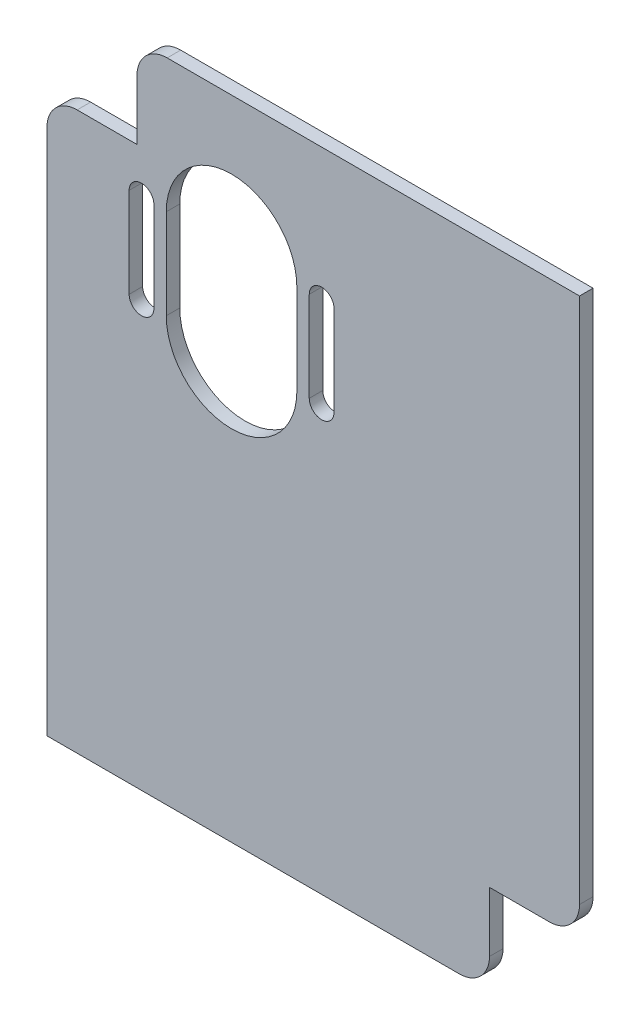
ISO-10303-21;
HEADER;
FILE_DESCRIPTION(('STEP AP214'),'2;1');
FILE_NAME('part.step','',(''),(''),'','','');
FILE_SCHEMA(('AUTOMOTIVE_DESIGN { 1 0 10303 214 1 1 1 1 }'));
ENDSEC;
DATA;
#1=APPLICATION_CONTEXT('core data for automotive mechanical design processes');
#2=APPLICATION_PROTOCOL_DEFINITION('international standard','automotive_design',2000,#1);
#3=PRODUCT_CONTEXT('',#1,'mechanical');
#4=PRODUCT('Part','Part','',(#3));
#5=PRODUCT_RELATED_PRODUCT_CATEGORY('part','',(#4));
#6=PRODUCT_DEFINITION_FORMATION('','',#4);
#7=PRODUCT_DEFINITION_CONTEXT('part definition',#1,'design');
#8=PRODUCT_DEFINITION('design','',#6,#7);
#9=PRODUCT_DEFINITION_SHAPE('','',#8);
#10=(LENGTH_UNIT() NAMED_UNIT(*) SI_UNIT(.MILLI.,.METRE.));
#11=(NAMED_UNIT(*) PLANE_ANGLE_UNIT() SI_UNIT($,.RADIAN.));
#12=(NAMED_UNIT(*) SI_UNIT($,.STERADIAN.) SOLID_ANGLE_UNIT());
#13=UNCERTAINTY_MEASURE_WITH_UNIT(LENGTH_MEASURE(1.E-05),#10,'distance_accuracy_value','');
#14=(GEOMETRIC_REPRESENTATION_CONTEXT(3) GLOBAL_UNCERTAINTY_ASSIGNED_CONTEXT((#13)) GLOBAL_UNIT_ASSIGNED_CONTEXT((#10,
#11,#12)) REPRESENTATION_CONTEXT('',''));
#15=CARTESIAN_POINT('',(0.,0.,0.));
#16=DIRECTION('',(0.,0.,1.));
#17=DIRECTION('',(1.,0.,0.));
#18=AXIS2_PLACEMENT_3D('',#15,#16,#17);
#19=CARTESIAN_POINT('',(0.,0.,3.));
#20=DIRECTION('',(1.,0.,0.));
#21=DIRECTION('',(0.,0.,-1.));
#22=AXIS2_PLACEMENT_3D('',#19,#20,#21);
#23=PLANE('',#22);
#24=DIRECTION('',(0.,-1.,0.));
#25=VECTOR('',#24,1.);
#26=CARTESIAN_POINT('',(0.,0.,3.));
#27=LINE('',#26,#25);
#28=CARTESIAN_POINT('',(0.,117.04,3.));
#29=VERTEX_POINT('',#28);
#30=CARTESIAN_POINT('',(0.,0.,3.));
#31=VERTEX_POINT('',#30);
#32=EDGE_CURVE('E326',#29,#31,#27,.T.);
#33=ORIENTED_EDGE('',*,*,#32,.F.);
#34=DIRECTION('',(0.,0.,1.));
#35=VECTOR('',#34,1.);
#36=CARTESIAN_POINT('',(0.,117.04,3.));
#37=LINE('',#36,#35);
#38=CARTESIAN_POINT('',(0.,117.04,0.));
#39=VERTEX_POINT('',#38);
#40=EDGE_CURVE('E11',#29,#39,#37,.F.);
#41=ORIENTED_EDGE('',*,*,#40,.T.);
#42=DIRECTION('',(0.,-1.,0.));
#43=VECTOR('',#42,1.);
#44=CARTESIAN_POINT('',(0.,0.,0.));
#45=LINE('',#44,#43);
#46=CARTESIAN_POINT('',(0.,0.,0.));
#47=VERTEX_POINT('',#46);
#48=EDGE_CURVE('E322',#39,#47,#45,.T.);
#49=ORIENTED_EDGE('',*,*,#48,.T.);
#50=DIRECTION('',(0.,0.,-1.));
#51=VECTOR('',#50,1.);
#52=CARTESIAN_POINT('',(0.,0.,3.));
#53=LINE('',#52,#51);
#54=EDGE_CURVE('E346',#31,#47,#53,.T.);
#55=ORIENTED_EDGE('',*,*,#54,.F.);
#56=EDGE_LOOP('',(#33,#41,#49,#55));
#57=FACE_BOUND('',#56,.T.);
#58=ADVANCED_FACE('F39',(#57),#23,.F.);
#59=CARTESIAN_POINT('',(118.275,0.,3.));
#60=DIRECTION('',(-1.,0.,0.));
#61=DIRECTION('',(0.,0.,1.));
#62=AXIS2_PLACEMENT_3D('',#59,#60,#61);
#63=PLANE('',#62);
#64=DIRECTION('',(0.,1.,0.));
#65=VECTOR('',#64,1.);
#66=CARTESIAN_POINT('',(118.275,0.,3.));
#67=LINE('',#66,#65);
#68=CARTESIAN_POINT('',(118.275,26.7,3.));
#69=VERTEX_POINT('',#68);
#70=CARTESIAN_POINT('',(118.275,143.74,3.));
#71=VERTEX_POINT('',#70);
#72=EDGE_CURVE('E335',#69,#71,#67,.T.);
#73=ORIENTED_EDGE('',*,*,#72,.F.);
#74=DIRECTION('',(0.,0.,1.));
#75=VECTOR('',#74,1.);
#76=CARTESIAN_POINT('',(118.275,26.7,3.));
#77=LINE('',#76,#75);
#78=CARTESIAN_POINT('',(118.275,26.7,0.));
#79=VERTEX_POINT('',#78);
#80=EDGE_CURVE('E382',#69,#79,#77,.F.);
#81=ORIENTED_EDGE('',*,*,#80,.T.);
#82=DIRECTION('',(0.,1.,0.));
#83=VECTOR('',#82,1.);
#84=CARTESIAN_POINT('',(118.275,0.,0.));
#85=LINE('',#84,#83);
#86=CARTESIAN_POINT('',(118.275,143.74,0.));
#87=VERTEX_POINT('',#86);
#88=EDGE_CURVE('E345',#79,#87,#85,.T.);
#89=ORIENTED_EDGE('',*,*,#88,.T.);
#90=DIRECTION('',(0.,0.,-1.));
#91=VECTOR('',#90,1.);
#92=CARTESIAN_POINT('',(118.275,143.74,3.));
#93=LINE('',#92,#91);
#94=EDGE_CURVE('E340',#71,#87,#93,.T.);
#95=ORIENTED_EDGE('',*,*,#94,.F.);
#96=EDGE_LOOP('',(#73,#81,#89,#95));
#97=FACE_BOUND('',#96,.T.);
#98=ADVANCED_FACE('F401',(#97),#63,.F.);
#99=CARTESIAN_POINT('',(0.,0.,3.));
#100=DIRECTION('',(0.,0.,-1.));
#101=DIRECTION('',(-1.,0.,0.));
#102=AXIS2_PLACEMENT_3D('',#99,#100,#101);
#103=PLANE('',#102);
#104=DIRECTION('',(0.,-1.,0.));
#105=VECTOR('',#104,1.);
#106=CARTESIAN_POINT('',(18.25,114.05,3.));
#107=LINE('',#106,#105);
#108=CARTESIAN_POINT('',(18.25,114.05,3.));
#109=VERTEX_POINT('',#108);
#110=CARTESIAN_POINT('',(18.25,94.05,3.));
#111=VERTEX_POINT('',#110);
#112=EDGE_CURVE('E285',#109,#111,#107,.T.);
#113=ORIENTED_EDGE('',*,*,#112,.F.);
#114=CARTESIAN_POINT('',(21.,114.05,3.));
#115=DIRECTION('',(0.,0.,1.));
#116=DIRECTION('',(1.,0.,0.));
#117=AXIS2_PLACEMENT_3D('',#114,#115,#116);
#118=CIRCLE('',#117,2.75);
#119=CARTESIAN_POINT('',(23.75,114.05,3.));
#120=VERTEX_POINT('',#119);
#121=EDGE_CURVE('E245',#120,#109,#118,.T.);
#122=ORIENTED_EDGE('',*,*,#121,.F.);
#123=DIRECTION('',(0.,1.,0.));
#124=VECTOR('',#123,1.);
#125=CARTESIAN_POINT('',(23.75,114.05,3.));
#126=LINE('',#125,#124);
#127=CARTESIAN_POINT('',(23.75,94.05,3.));
#128=VERTEX_POINT('',#127);
#129=EDGE_CURVE('E273',#128,#120,#126,.T.);
#130=ORIENTED_EDGE('',*,*,#129,.F.);
#131=CARTESIAN_POINT('',(21.,94.05,3.));
#132=DIRECTION('',(0.,0.,1.));
#133=DIRECTION('',(1.,0.,0.));
#134=AXIS2_PLACEMENT_3D('',#131,#132,#133);
#135=CIRCLE('',#134,2.75);
#136=EDGE_CURVE('E279',#111,#128,#135,.T.);
#137=ORIENTED_EDGE('',*,*,#136,.F.);
#138=EDGE_LOOP('',(#113,#122,#130,#137));
#139=FACE_BOUND('',#138,.T.);
#140=DIRECTION('',(0.,-1.,0.));
#141=VECTOR('',#140,1.);
#142=CARTESIAN_POINT('',(58.25,114.05,3.));
#143=LINE('',#142,#141);
#144=CARTESIAN_POINT('',(58.25,114.05,3.));
#145=VERTEX_POINT('',#144);
#146=CARTESIAN_POINT('',(58.25,94.05,3.));
#147=VERTEX_POINT('',#146);
#148=EDGE_CURVE('E249',#145,#147,#143,.T.);
#149=ORIENTED_EDGE('',*,*,#148,.F.);
#150=CARTESIAN_POINT('',(61.,114.05,3.));
#151=DIRECTION('',(0.,0.,1.));
#152=DIRECTION('',(1.,0.,0.));
#153=AXIS2_PLACEMENT_3D('',#150,#151,#152);
#154=CIRCLE('',#153,2.75000000000002);
#155=CARTESIAN_POINT('',(63.75,114.05,3.));
#156=VERTEX_POINT('',#155);
#157=EDGE_CURVE('E254',#156,#145,#154,.T.);
#158=ORIENTED_EDGE('',*,*,#157,.F.);
#159=DIRECTION('',(0.,1.,0.));
#160=VECTOR('',#159,1.);
#161=CARTESIAN_POINT('',(63.75,114.05,3.));
#162=LINE('',#161,#160);
#163=CARTESIAN_POINT('',(63.75,94.05,3.));
#164=VERTEX_POINT('',#163);
#165=EDGE_CURVE('E243',#164,#156,#162,.T.);
#166=ORIENTED_EDGE('',*,*,#165,.F.);
#167=CARTESIAN_POINT('',(61.,94.05,3.));
#168=DIRECTION('',(0.,0.,1.));
#169=DIRECTION('',(1.,0.,0.));
#170=AXIS2_PLACEMENT_3D('',#167,#168,#169);
#171=CIRCLE('',#170,2.75000000000001);
#172=EDGE_CURVE('E246',#147,#164,#171,.T.);
#173=ORIENTED_EDGE('',*,*,#172,.F.);
#174=EDGE_LOOP('',(#149,#158,#166,#173));
#175=FACE_BOUND('',#174,.T.);
#176=DIRECTION('',(0.,-1.,0.));
#177=VECTOR('',#176,1.);
#178=CARTESIAN_POINT('',(26.5,114.05,3.));
#179=LINE('',#178,#177);
#180=CARTESIAN_POINT('',(26.5,114.05,3.));
#181=VERTEX_POINT('',#180);
#182=CARTESIAN_POINT('',(26.5,94.05,3.));
#183=VERTEX_POINT('',#182);
#184=EDGE_CURVE('E311',#181,#183,#179,.T.);
#185=ORIENTED_EDGE('',*,*,#184,.F.);
#186=CARTESIAN_POINT('',(41.,114.05,3.));
#187=DIRECTION('',(0.,0.,1.));
#188=DIRECTION('',(1.,0.,0.));
#189=AXIS2_PLACEMENT_3D('',#186,#187,#188);
#190=CIRCLE('',#189,14.5);
#191=CARTESIAN_POINT('',(55.5,114.05,3.));
#192=VERTEX_POINT('',#191);
#193=EDGE_CURVE('E253',#192,#181,#190,.T.);
#194=ORIENTED_EDGE('',*,*,#193,.F.);
#195=DIRECTION('',(0.,1.,0.));
#196=VECTOR('',#195,1.);
#197=CARTESIAN_POINT('',(55.5,114.05,3.));
#198=LINE('',#197,#196);
#199=CARTESIAN_POINT('',(55.5,94.05,3.));
#200=VERTEX_POINT('',#199);
#201=EDGE_CURVE('E297',#200,#192,#198,.T.);
#202=ORIENTED_EDGE('',*,*,#201,.F.);
#203=CARTESIAN_POINT('',(41.,94.05,3.));
#204=DIRECTION('',(0.,0.,1.));
#205=DIRECTION('',(1.,0.,0.));
#206=AXIS2_PLACEMENT_3D('',#203,#204,#205);
#207=CIRCLE('',#206,14.5);
#208=EDGE_CURVE('E313',#183,#200,#207,.T.);
#209=ORIENTED_EDGE('',*,*,#208,.F.);
#210=EDGE_LOOP('',(#185,#194,#202,#209));
#211=FACE_BOUND('',#210,.T.);
#212=DIRECTION('',(1.,0.,0.));
#213=VECTOR('',#212,1.);
#214=CARTESIAN_POINT('',(0.,0.,3.));
#215=LINE('',#214,#213);
#216=CARTESIAN_POINT('',(91.575,0.,3.));
#217=VERTEX_POINT('',#216);
#218=EDGE_CURVE('E329',#31,#217,#215,.T.);
#219=ORIENTED_EDGE('',*,*,#218,.T.);
#220=CARTESIAN_POINT('',(91.575,6.7,3.));
#221=DIRECTION('',(0.,0.,-1.));
#222=DIRECTION('',(-1.,0.,0.));
#223=AXIS2_PLACEMENT_3D('',#220,#221,#222);
#224=CIRCLE('',#223,6.7);
#225=CARTESIAN_POINT('',(98.275,6.7,3.));
#226=VERTEX_POINT('',#225);
#227=EDGE_CURVE('E370',#217,#226,#224,.F.);
#228=ORIENTED_EDGE('',*,*,#227,.T.);
#229=DIRECTION('',(0.,-1.,0.));
#230=VECTOR('',#229,1.);
#231=CARTESIAN_POINT('',(98.275,0.,3.));
#232=LINE('',#231,#230);
#233=CARTESIAN_POINT('',(98.275,20.,3.));
#234=VERTEX_POINT('',#233);
#235=EDGE_CURVE('E226',#234,#226,#232,.T.);
#236=ORIENTED_EDGE('',*,*,#235,.F.);
#237=DIRECTION('',(-1.,0.,0.));
#238=VECTOR('',#237,1.);
#239=CARTESIAN_POINT('',(118.275,20.,3.));
#240=LINE('',#239,#238);
#241=CARTESIAN_POINT('',(111.575,20.,3.));
#242=VERTEX_POINT('',#241);
#243=EDGE_CURVE('E209',#242,#234,#240,.T.);
#244=ORIENTED_EDGE('',*,*,#243,.F.);
#245=CARTESIAN_POINT('',(111.575,26.7,3.));
#246=DIRECTION('',(0.,0.,-1.));
#247=DIRECTION('',(-1.,0.,0.));
#248=AXIS2_PLACEMENT_3D('',#245,#246,#247);
#249=CIRCLE('',#248,6.7);
#250=EDGE_CURVE('E362',#242,#69,#249,.F.);
#251=ORIENTED_EDGE('',*,*,#250,.T.);
#252=ORIENTED_EDGE('',*,*,#72,.T.);
#253=DIRECTION('',(-1.,0.,0.));
#254=VECTOR('',#253,1.);
#255=CARTESIAN_POINT('',(0.,143.74,3.));
#256=LINE('',#255,#254);
#257=CARTESIAN_POINT('',(26.7,143.74,3.));
#258=VERTEX_POINT('',#257);
#259=EDGE_CURVE('E332',#71,#258,#256,.T.);
#260=ORIENTED_EDGE('',*,*,#259,.T.);
#261=CARTESIAN_POINT('',(26.7,137.04,3.));
#262=DIRECTION('',(0.,0.,-1.));
#263=DIRECTION('',(-1.,0.,0.));
#264=AXIS2_PLACEMENT_3D('',#261,#262,#263);
#265=CIRCLE('',#264,6.7);
#266=CARTESIAN_POINT('',(20.,137.04,3.));
#267=VERTEX_POINT('',#266);
#268=EDGE_CURVE('E221',#258,#267,#265,.F.);
#269=ORIENTED_EDGE('',*,*,#268,.T.);
#270=DIRECTION('',(0.,1.,0.));
#271=VECTOR('',#270,1.);
#272=CARTESIAN_POINT('',(20.,143.74,3.));
#273=LINE('',#272,#271);
#274=CARTESIAN_POINT('',(20.,123.74,3.));
#275=VERTEX_POINT('',#274);
#276=EDGE_CURVE('E206',#275,#267,#273,.T.);
#277=ORIENTED_EDGE('',*,*,#276,.F.);
#278=DIRECTION('',(1.,0.,0.));
#279=VECTOR('',#278,1.);
#280=CARTESIAN_POINT('',(0.,123.74,3.));
#281=LINE('',#280,#279);
#282=CARTESIAN_POINT('',(6.7,123.74,3.));
#283=VERTEX_POINT('',#282);
#284=EDGE_CURVE('E204',#283,#275,#281,.T.);
#285=ORIENTED_EDGE('',*,*,#284,.F.);
#286=CARTESIAN_POINT('',(6.7,117.04,3.));
#287=DIRECTION('',(0.,0.,-1.));
#288=DIRECTION('',(-1.,0.,0.));
#289=AXIS2_PLACEMENT_3D('',#286,#287,#288);
#290=CIRCLE('',#289,6.7);
#291=EDGE_CURVE('E365',#283,#29,#290,.F.);
#292=ORIENTED_EDGE('',*,*,#291,.T.);
#293=ORIENTED_EDGE('',*,*,#32,.T.);
#294=EDGE_LOOP('',(#219,#228,#236,#244,#251,#252,#260,#269,#277,#285,#292,#293));
#295=FACE_BOUND('',#294,.T.);
#296=ADVANCED_FACE('F219',(#139,#175,#211,#295),#103,.F.);
#297=CARTESIAN_POINT('',(0.,0.,3.));
#298=DIRECTION('',(0.,1.,0.));
#299=DIRECTION('',(0.,0.,1.));
#300=AXIS2_PLACEMENT_3D('',#297,#298,#299);
#301=PLANE('',#300);
#302=DIRECTION('',(1.,0.,0.));
#303=VECTOR('',#302,1.);
#304=CARTESIAN_POINT('',(0.,0.,0.));
#305=LINE('',#304,#303);
#306=CARTESIAN_POINT('',(91.575,0.,0.));
#307=VERTEX_POINT('',#306);
#308=EDGE_CURVE('E339',#47,#307,#305,.T.);
#309=ORIENTED_EDGE('',*,*,#308,.T.);
#310=DIRECTION('',(0.,0.,1.));
#311=VECTOR('',#310,1.);
#312=CARTESIAN_POINT('',(91.575,0.,3.));
#313=LINE('',#312,#311);
#314=EDGE_CURVE('E360',#307,#217,#313,.T.);
#315=ORIENTED_EDGE('',*,*,#314,.T.);
#316=ORIENTED_EDGE('',*,*,#218,.F.);
#317=ORIENTED_EDGE('',*,*,#54,.T.);
#318=EDGE_LOOP('',(#309,#315,#316,#317));
#319=FACE_BOUND('',#318,.T.);
#320=ADVANCED_FACE('F421',(#319),#301,.F.);
#321=CARTESIAN_POINT('',(0.,143.74,3.));
#322=DIRECTION('',(0.,-1.,0.));
#323=DIRECTION('',(0.,0.,-1.));
#324=AXIS2_PLACEMENT_3D('',#321,#322,#323);
#325=PLANE('',#324);
#326=DIRECTION('',(-1.,0.,0.));
#327=VECTOR('',#326,1.);
#328=CARTESIAN_POINT('',(0.,143.74,0.));
#329=LINE('',#328,#327);
#330=CARTESIAN_POINT('',(26.7,143.74,0.));
#331=VERTEX_POINT('',#330);
#332=EDGE_CURVE('E334',#87,#331,#329,.T.);
#333=ORIENTED_EDGE('',*,*,#332,.T.);
#334=DIRECTION('',(0.,0.,1.));
#335=VECTOR('',#334,1.);
#336=CARTESIAN_POINT('',(26.7,143.74,3.));
#337=LINE('',#336,#335);
#338=EDGE_CURVE('E384',#331,#258,#337,.T.);
#339=ORIENTED_EDGE('',*,*,#338,.T.);
#340=ORIENTED_EDGE('',*,*,#259,.F.);
#341=ORIENTED_EDGE('',*,*,#94,.T.);
#342=EDGE_LOOP('',(#333,#339,#340,#341));
#343=FACE_BOUND('',#342,.T.);
#344=ADVANCED_FACE('F396',(#343),#325,.F.);
#345=CARTESIAN_POINT('',(0.,0.,0.));
#346=DIRECTION('',(0.,0.,-1.));
#347=DIRECTION('',(-1.,0.,0.));
#348=AXIS2_PLACEMENT_3D('',#345,#346,#347);
#349=PLANE('',#348);
#350=DIRECTION('',(0.,1.,0.));
#351=VECTOR('',#350,1.);
#352=CARTESIAN_POINT('',(98.275,0.,0.));
#353=LINE('',#352,#351);
#354=CARTESIAN_POINT('',(98.275,6.7,0.));
#355=VERTEX_POINT('',#354);
#356=CARTESIAN_POINT('',(98.275,20.,0.));
#357=VERTEX_POINT('',#356);
#358=EDGE_CURVE('E353',#355,#357,#353,.T.);
#359=ORIENTED_EDGE('',*,*,#358,.F.);
#360=CARTESIAN_POINT('',(91.575,6.7,0.));
#361=DIRECTION('',(0.,0.,-1.));
#362=DIRECTION('',(-1.,0.,0.));
#363=AXIS2_PLACEMENT_3D('',#360,#361,#362);
#364=CIRCLE('',#363,6.7);
#365=EDGE_CURVE('E376',#355,#307,#364,.T.);
#366=ORIENTED_EDGE('',*,*,#365,.T.);
#367=ORIENTED_EDGE('',*,*,#308,.F.);
#368=ORIENTED_EDGE('',*,*,#48,.F.);
#369=CARTESIAN_POINT('',(6.7,117.04,0.));
#370=DIRECTION('',(0.,0.,-1.));
#371=DIRECTION('',(-1.,0.,0.));
#372=AXIS2_PLACEMENT_3D('',#369,#370,#371);
#373=CIRCLE('',#372,6.7);
#374=CARTESIAN_POINT('',(6.7,123.74,0.));
#375=VERTEX_POINT('',#374);
#376=EDGE_CURVE('E53',#39,#375,#373,.T.);
#377=ORIENTED_EDGE('',*,*,#376,.T.);
#378=DIRECTION('',(-1.,0.,0.));
#379=VECTOR('',#378,1.);
#380=CARTESIAN_POINT('',(0.,123.74,0.));
#381=LINE('',#380,#379);
#382=CARTESIAN_POINT('',(20.,123.74,0.));
#383=VERTEX_POINT('',#382);
#384=EDGE_CURVE('E358',#383,#375,#381,.T.);
#385=ORIENTED_EDGE('',*,*,#384,.F.);
#386=DIRECTION('',(0.,-1.,0.));
#387=VECTOR('',#386,1.);
#388=CARTESIAN_POINT('',(20.,0.,0.));
#389=LINE('',#388,#387);
#390=CARTESIAN_POINT('',(20.,137.04,0.));
#391=VERTEX_POINT('',#390);
#392=EDGE_CURVE('E218',#391,#383,#389,.T.);
#393=ORIENTED_EDGE('',*,*,#392,.F.);
#394=CARTESIAN_POINT('',(26.7,137.04,0.));
#395=DIRECTION('',(0.,0.,-1.));
#396=DIRECTION('',(-1.,0.,0.));
#397=AXIS2_PLACEMENT_3D('',#394,#395,#396);
#398=CIRCLE('',#397,6.7);
#399=EDGE_CURVE('E375',#391,#331,#398,.T.);
#400=ORIENTED_EDGE('',*,*,#399,.T.);
#401=ORIENTED_EDGE('',*,*,#332,.F.);
#402=ORIENTED_EDGE('',*,*,#88,.F.);
#403=CARTESIAN_POINT('',(111.575,26.7,0.));
#404=DIRECTION('',(0.,0.,-1.));
#405=DIRECTION('',(-1.,0.,0.));
#406=AXIS2_PLACEMENT_3D('',#403,#404,#405);
#407=CIRCLE('',#406,6.7);
#408=CARTESIAN_POINT('',(111.575,20.,0.));
#409=VERTEX_POINT('',#408);
#410=EDGE_CURVE('E372',#79,#409,#407,.T.);
#411=ORIENTED_EDGE('',*,*,#410,.T.);
#412=DIRECTION('',(1.,0.,0.));
#413=VECTOR('',#412,1.);
#414=CARTESIAN_POINT('',(0.,20.,0.));
#415=LINE('',#414,#413);
#416=EDGE_CURVE('E354',#357,#409,#415,.T.);
#417=ORIENTED_EDGE('',*,*,#416,.F.);
#418=EDGE_LOOP('',(#359,#366,#367,#368,#377,#385,#393,#400,#401,#402,#411,#417));
#419=FACE_BOUND('',#418,.T.);
#420=CARTESIAN_POINT('',(21.,114.05,0.));
#421=DIRECTION('',(0.,0.,1.));
#422=DIRECTION('',(1.,0.,0.));
#423=AXIS2_PLACEMENT_3D('',#420,#421,#422);
#424=CIRCLE('',#423,2.75);
#425=CARTESIAN_POINT('',(23.75,114.05,0.));
#426=VERTEX_POINT('',#425);
#427=CARTESIAN_POINT('',(18.25,114.05,0.));
#428=VERTEX_POINT('',#427);
#429=EDGE_CURVE('E276',#426,#428,#424,.T.);
#430=ORIENTED_EDGE('',*,*,#429,.T.);
#431=DIRECTION('',(0.,-1.,0.));
#432=VECTOR('',#431,1.);
#433=CARTESIAN_POINT('',(18.25,114.05,0.));
#434=LINE('',#433,#432);
#435=CARTESIAN_POINT('',(18.25,94.05,0.));
#436=VERTEX_POINT('',#435);
#437=EDGE_CURVE('E293',#428,#436,#434,.T.);
#438=ORIENTED_EDGE('',*,*,#437,.T.);
#439=CARTESIAN_POINT('',(21.,94.05,0.));
#440=DIRECTION('',(0.,0.,1.));
#441=DIRECTION('',(1.,0.,0.));
#442=AXIS2_PLACEMENT_3D('',#439,#440,#441);
#443=CIRCLE('',#442,2.75);
#444=CARTESIAN_POINT('',(23.75,94.05,0.));
#445=VERTEX_POINT('',#444);
#446=EDGE_CURVE('E290',#436,#445,#443,.T.);
#447=ORIENTED_EDGE('',*,*,#446,.T.);
#448=DIRECTION('',(0.,1.,0.));
#449=VECTOR('',#448,1.);
#450=CARTESIAN_POINT('',(23.75,114.05,0.));
#451=LINE('',#450,#449);
#452=EDGE_CURVE('E268',#445,#426,#451,.T.);
#453=ORIENTED_EDGE('',*,*,#452,.T.);
#454=EDGE_LOOP('',(#430,#438,#447,#453));
#455=FACE_BOUND('',#454,.T.);
#456=CARTESIAN_POINT('',(61.,114.05,0.));
#457=DIRECTION('',(0.,0.,1.));
#458=DIRECTION('',(1.,0.,0.));
#459=AXIS2_PLACEMENT_3D('',#456,#457,#458);
#460=CIRCLE('',#459,2.75000000000002);
#461=CARTESIAN_POINT('',(63.75,114.05,0.));
#462=VERTEX_POINT('',#461);
#463=CARTESIAN_POINT('',(58.25,114.05,0.));
#464=VERTEX_POINT('',#463);
#465=EDGE_CURVE('E250',#462,#464,#460,.T.);
#466=ORIENTED_EDGE('',*,*,#465,.T.);
#467=DIRECTION('',(0.,-1.,0.));
#468=VECTOR('',#467,1.);
#469=CARTESIAN_POINT('',(58.25,114.05,0.));
#470=LINE('',#469,#468);
#471=CARTESIAN_POINT('',(58.25,94.05,0.));
#472=VERTEX_POINT('',#471);
#473=EDGE_CURVE('E263',#464,#472,#470,.T.);
#474=ORIENTED_EDGE('',*,*,#473,.T.);
#475=CARTESIAN_POINT('',(61.,94.05,0.));
#476=DIRECTION('',(0.,0.,1.));
#477=DIRECTION('',(1.,0.,0.));
#478=AXIS2_PLACEMENT_3D('',#475,#476,#477);
#479=CIRCLE('',#478,2.75000000000001);
#480=CARTESIAN_POINT('',(63.75,94.05,0.));
#481=VERTEX_POINT('',#480);
#482=EDGE_CURVE('E259',#472,#481,#479,.T.);
#483=ORIENTED_EDGE('',*,*,#482,.T.);
#484=DIRECTION('',(0.,1.,0.));
#485=VECTOR('',#484,1.);
#486=CARTESIAN_POINT('',(63.75,114.05,0.));
#487=LINE('',#486,#485);
#488=EDGE_CURVE('E232',#481,#462,#487,.T.);
#489=ORIENTED_EDGE('',*,*,#488,.T.);
#490=EDGE_LOOP('',(#466,#474,#483,#489));
#491=FACE_BOUND('',#490,.T.);
#492=CARTESIAN_POINT('',(41.,114.05,0.));
#493=DIRECTION('',(0.,0.,1.));
#494=DIRECTION('',(1.,0.,0.));
#495=AXIS2_PLACEMENT_3D('',#492,#493,#494);
#496=CIRCLE('',#495,14.5);
#497=CARTESIAN_POINT('',(55.5,114.05,0.));
#498=VERTEX_POINT('',#497);
#499=CARTESIAN_POINT('',(26.5,114.05,0.));
#500=VERTEX_POINT('',#499);
#501=EDGE_CURVE('E298',#498,#500,#496,.T.);
#502=ORIENTED_EDGE('',*,*,#501,.T.);
#503=DIRECTION('',(0.,-1.,0.));
#504=VECTOR('',#503,1.);
#505=CARTESIAN_POINT('',(26.5,114.05,0.));
#506=LINE('',#505,#504);
#507=CARTESIAN_POINT('',(26.5,94.05,0.));
#508=VERTEX_POINT('',#507);
#509=EDGE_CURVE('E299',#500,#508,#506,.T.);
#510=ORIENTED_EDGE('',*,*,#509,.T.);
#511=CARTESIAN_POINT('',(41.,94.05,0.));
#512=DIRECTION('',(0.,0.,1.));
#513=DIRECTION('',(1.,0.,0.));
#514=AXIS2_PLACEMENT_3D('',#511,#512,#513);
#515=CIRCLE('',#514,14.5);
#516=CARTESIAN_POINT('',(55.5,94.05,0.));
#517=VERTEX_POINT('',#516);
#518=EDGE_CURVE('E303',#508,#517,#515,.T.);
#519=ORIENTED_EDGE('',*,*,#518,.T.);
#520=DIRECTION('',(0.,1.,0.));
#521=VECTOR('',#520,1.);
#522=CARTESIAN_POINT('',(55.5,114.05,0.));
#523=LINE('',#522,#521);
#524=EDGE_CURVE('E306',#517,#498,#523,.T.);
#525=ORIENTED_EDGE('',*,*,#524,.T.);
#526=EDGE_LOOP('',(#502,#510,#519,#525));
#527=FACE_BOUND('',#526,.T.);
#528=ADVANCED_FACE('F388',(#419,#455,#491,#527),#349,.T.);
#529=CARTESIAN_POINT('',(41.,114.05,0.));
#530=DIRECTION('',(0.,0.,1.));
#531=DIRECTION('',(1.,0.,0.));
#532=AXIS2_PLACEMENT_3D('',#529,#530,#531);
#533=CYLINDRICAL_SURFACE('',#532,14.5);
#534=ORIENTED_EDGE('',*,*,#193,.T.);
#535=DIRECTION('',(0.,0.,1.));
#536=VECTOR('',#535,1.);
#537=CARTESIAN_POINT('',(26.5,114.05,0.));
#538=LINE('',#537,#536);
#539=EDGE_CURVE('E307',#500,#181,#538,.T.);
#540=ORIENTED_EDGE('',*,*,#539,.F.);
#541=ORIENTED_EDGE('',*,*,#501,.F.);
#542=DIRECTION('',(0.,0.,1.));
#543=VECTOR('',#542,1.);
#544=CARTESIAN_POINT('',(55.5,114.05,0.));
#545=LINE('',#544,#543);
#546=EDGE_CURVE('E316',#498,#192,#545,.T.);
#547=ORIENTED_EDGE('',*,*,#546,.T.);
#548=EDGE_LOOP('',(#534,#540,#541,#547));
#549=FACE_BOUND('',#548,.T.);
#550=ADVANCED_FACE('F608',(#549),#533,.F.);
#551=CARTESIAN_POINT('',(55.5,114.05,0.));
#552=DIRECTION('',(1.,0.,0.));
#553=DIRECTION('',(0.,1.,0.));
#554=AXIS2_PLACEMENT_3D('',#551,#552,#553);
#555=PLANE('',#554);
#556=ORIENTED_EDGE('',*,*,#201,.T.);
#557=ORIENTED_EDGE('',*,*,#546,.F.);
#558=ORIENTED_EDGE('',*,*,#524,.F.);
#559=DIRECTION('',(0.,0.,1.));
#560=VECTOR('',#559,1.);
#561=CARTESIAN_POINT('',(55.5,94.05,0.));
#562=LINE('',#561,#560);
#563=EDGE_CURVE('E325',#517,#200,#562,.T.);
#564=ORIENTED_EDGE('',*,*,#563,.T.);
#565=EDGE_LOOP('',(#556,#557,#558,#564));
#566=FACE_BOUND('',#565,.T.);
#567=ADVANCED_FACE('F600',(#566),#555,.F.);
#568=CARTESIAN_POINT('',(41.,94.05,0.));
#569=DIRECTION('',(0.,0.,1.));
#570=DIRECTION('',(1.,0.,0.));
#571=AXIS2_PLACEMENT_3D('',#568,#569,#570);
#572=CYLINDRICAL_SURFACE('',#571,14.5);
#573=ORIENTED_EDGE('',*,*,#208,.T.);
#574=ORIENTED_EDGE('',*,*,#563,.F.);
#575=ORIENTED_EDGE('',*,*,#518,.F.);
#576=DIRECTION('',(0.,0.,1.));
#577=VECTOR('',#576,1.);
#578=CARTESIAN_POINT('',(26.5,94.05,0.));
#579=LINE('',#578,#577);
#580=EDGE_CURVE('E321',#508,#183,#579,.T.);
#581=ORIENTED_EDGE('',*,*,#580,.T.);
#582=EDGE_LOOP('',(#573,#574,#575,#581));
#583=FACE_BOUND('',#582,.T.);
#584=ADVANCED_FACE('F586',(#583),#572,.F.);
#585=CARTESIAN_POINT('',(26.5,114.05,0.));
#586=DIRECTION('',(-1.,0.,0.));
#587=DIRECTION('',(0.,-1.,0.));
#588=AXIS2_PLACEMENT_3D('',#585,#586,#587);
#589=PLANE('',#588);
#590=ORIENTED_EDGE('',*,*,#184,.T.);
#591=ORIENTED_EDGE('',*,*,#580,.F.);
#592=ORIENTED_EDGE('',*,*,#509,.F.);
#593=ORIENTED_EDGE('',*,*,#539,.T.);
#594=EDGE_LOOP('',(#590,#591,#592,#593));
#595=FACE_BOUND('',#594,.T.);
#596=ADVANCED_FACE('F576',(#595),#589,.F.);
#597=CARTESIAN_POINT('',(61.,114.05,0.));
#598=DIRECTION('',(0.,0.,1.));
#599=DIRECTION('',(1.,0.,0.));
#600=AXIS2_PLACEMENT_3D('',#597,#598,#599);
#601=CYLINDRICAL_SURFACE('',#600,2.75000000000002);
#602=ORIENTED_EDGE('',*,*,#157,.T.);
#603=DIRECTION('',(0.,0.,1.));
#604=VECTOR('',#603,1.);
#605=CARTESIAN_POINT('',(58.25,114.05,0.));
#606=LINE('',#605,#604);
#607=EDGE_CURVE('E235',#464,#145,#606,.T.);
#608=ORIENTED_EDGE('',*,*,#607,.F.);
#609=ORIENTED_EDGE('',*,*,#465,.F.);
#610=DIRECTION('',(0.,0.,1.));
#611=VECTOR('',#610,1.);
#612=CARTESIAN_POINT('',(63.75,114.05,0.));
#613=LINE('',#612,#611);
#614=EDGE_CURVE('E239',#462,#156,#613,.T.);
#615=ORIENTED_EDGE('',*,*,#614,.T.);
#616=EDGE_LOOP('',(#602,#608,#609,#615));
#617=FACE_BOUND('',#616,.T.);
#618=ADVANCED_FACE('F569',(#617),#601,.F.);
#619=CARTESIAN_POINT('',(63.75,114.05,0.));
#620=DIRECTION('',(1.,0.,0.));
#621=DIRECTION('',(0.,0.,-1.));
#622=AXIS2_PLACEMENT_3D('',#619,#620,#621);
#623=PLANE('',#622);
#624=ORIENTED_EDGE('',*,*,#165,.T.);
#625=ORIENTED_EDGE('',*,*,#614,.F.);
#626=ORIENTED_EDGE('',*,*,#488,.F.);
#627=DIRECTION('',(0.,0.,1.));
#628=VECTOR('',#627,1.);
#629=CARTESIAN_POINT('',(63.75,94.05,0.));
#630=LINE('',#629,#628);
#631=EDGE_CURVE('E238',#481,#164,#630,.T.);
#632=ORIENTED_EDGE('',*,*,#631,.T.);
#633=EDGE_LOOP('',(#624,#625,#626,#632));
#634=FACE_BOUND('',#633,.T.);
#635=ADVANCED_FACE('F561',(#634),#623,.F.);
#636=CARTESIAN_POINT('',(61.,94.05,0.));
#637=DIRECTION('',(0.,0.,1.));
#638=DIRECTION('',(1.,0.,0.));
#639=AXIS2_PLACEMENT_3D('',#636,#637,#638);
#640=CYLINDRICAL_SURFACE('',#639,2.75000000000001);
#641=ORIENTED_EDGE('',*,*,#172,.T.);
#642=ORIENTED_EDGE('',*,*,#631,.F.);
#643=ORIENTED_EDGE('',*,*,#482,.F.);
#644=DIRECTION('',(0.,0.,1.));
#645=VECTOR('',#644,1.);
#646=CARTESIAN_POINT('',(58.25,94.05,0.));
#647=LINE('',#646,#645);
#648=EDGE_CURVE('E236',#472,#147,#647,.T.);
#649=ORIENTED_EDGE('',*,*,#648,.T.);
#650=EDGE_LOOP('',(#641,#642,#643,#649));
#651=FACE_BOUND('',#650,.T.);
#652=ADVANCED_FACE('F552',(#651),#640,.F.);
#653=CARTESIAN_POINT('',(58.25,114.05,0.));
#654=DIRECTION('',(-1.,0.,0.));
#655=DIRECTION('',(0.,-1.,0.));
#656=AXIS2_PLACEMENT_3D('',#653,#654,#655);
#657=PLANE('',#656);
#658=ORIENTED_EDGE('',*,*,#148,.T.);
#659=ORIENTED_EDGE('',*,*,#648,.F.);
#660=ORIENTED_EDGE('',*,*,#473,.F.);
#661=ORIENTED_EDGE('',*,*,#607,.T.);
#662=EDGE_LOOP('',(#658,#659,#660,#661));
#663=FACE_BOUND('',#662,.T.);
#664=ADVANCED_FACE('F541',(#663),#657,.F.);
#665=CARTESIAN_POINT('',(21.,114.05,0.));
#666=DIRECTION('',(0.,0.,1.));
#667=DIRECTION('',(1.,0.,0.));
#668=AXIS2_PLACEMENT_3D('',#665,#666,#667);
#669=CYLINDRICAL_SURFACE('',#668,2.75);
#670=ORIENTED_EDGE('',*,*,#121,.T.);
#671=DIRECTION('',(0.,0.,1.));
#672=VECTOR('',#671,1.);
#673=CARTESIAN_POINT('',(18.25,114.05,0.));
#674=LINE('',#673,#672);
#675=EDGE_CURVE('E269',#428,#109,#674,.T.);
#676=ORIENTED_EDGE('',*,*,#675,.F.);
#677=ORIENTED_EDGE('',*,*,#429,.F.);
#678=DIRECTION('',(0.,0.,1.));
#679=VECTOR('',#678,1.);
#680=CARTESIAN_POINT('',(23.75,114.05,0.));
#681=LINE('',#680,#679);
#682=EDGE_CURVE('E220',#426,#120,#681,.T.);
#683=ORIENTED_EDGE('',*,*,#682,.T.);
#684=EDGE_LOOP('',(#670,#676,#677,#683));
#685=FACE_BOUND('',#684,.T.);
#686=ADVANCED_FACE('F534',(#685),#669,.F.);
#687=CARTESIAN_POINT('',(23.75,114.05,0.));
#688=DIRECTION('',(1.,0.,0.));
#689=DIRECTION('',(0.,1.,0.));
#690=AXIS2_PLACEMENT_3D('',#687,#688,#689);
#691=PLANE('',#690);
#692=ORIENTED_EDGE('',*,*,#129,.T.);
#693=ORIENTED_EDGE('',*,*,#682,.F.);
#694=ORIENTED_EDGE('',*,*,#452,.F.);
#695=DIRECTION('',(0.,0.,1.));
#696=VECTOR('',#695,1.);
#697=CARTESIAN_POINT('',(23.75,94.05,0.));
#698=LINE('',#697,#696);
#699=EDGE_CURVE('E275',#445,#128,#698,.T.);
#700=ORIENTED_EDGE('',*,*,#699,.T.);
#701=EDGE_LOOP('',(#692,#693,#694,#700));
#702=FACE_BOUND('',#701,.T.);
#703=ADVANCED_FACE('F524',(#702),#691,.F.);
#704=CARTESIAN_POINT('',(21.,94.05,0.));
#705=DIRECTION('',(0.,0.,1.));
#706=DIRECTION('',(1.,0.,0.));
#707=AXIS2_PLACEMENT_3D('',#704,#705,#706);
#708=CYLINDRICAL_SURFACE('',#707,2.75);
#709=ORIENTED_EDGE('',*,*,#136,.T.);
#710=ORIENTED_EDGE('',*,*,#699,.F.);
#711=ORIENTED_EDGE('',*,*,#446,.F.);
#712=DIRECTION('',(0.,0.,1.));
#713=VECTOR('',#712,1.);
#714=CARTESIAN_POINT('',(18.25,94.05,0.));
#715=LINE('',#714,#713);
#716=EDGE_CURVE('E267',#436,#111,#715,.T.);
#717=ORIENTED_EDGE('',*,*,#716,.T.);
#718=EDGE_LOOP('',(#709,#710,#711,#717));
#719=FACE_BOUND('',#718,.T.);
#720=ADVANCED_FACE('F517',(#719),#708,.F.);
#721=CARTESIAN_POINT('',(18.25,114.05,0.));
#722=DIRECTION('',(-1.,0.,0.));
#723=DIRECTION('',(0.,-1.,0.));
#724=AXIS2_PLACEMENT_3D('',#721,#722,#723);
#725=PLANE('',#724);
#726=ORIENTED_EDGE('',*,*,#112,.T.);
#727=ORIENTED_EDGE('',*,*,#716,.F.);
#728=ORIENTED_EDGE('',*,*,#437,.F.);
#729=ORIENTED_EDGE('',*,*,#675,.T.);
#730=EDGE_LOOP('',(#726,#727,#728,#729));
#731=FACE_BOUND('',#730,.T.);
#732=ADVANCED_FACE('F489',(#731),#725,.F.);
#733=CARTESIAN_POINT('',(98.275,0.,-7.));
#734=DIRECTION('',(-1.,0.,0.));
#735=DIRECTION('',(0.,0.,1.));
#736=AXIS2_PLACEMENT_3D('',#733,#734,#735);
#737=PLANE('',#736);
#738=ORIENTED_EDGE('',*,*,#235,.T.);
#739=DIRECTION('',(0.,0.,1.));
#740=VECTOR('',#739,1.);
#741=CARTESIAN_POINT('',(98.275,6.7,-7.));
#742=LINE('',#741,#740);
#743=EDGE_CURVE('E367',#226,#355,#742,.F.);
#744=ORIENTED_EDGE('',*,*,#743,.T.);
#745=ORIENTED_EDGE('',*,*,#358,.T.);
#746=DIRECTION('',(0.,0.,1.));
#747=VECTOR('',#746,1.);
#748=CARTESIAN_POINT('',(98.275,20.,-7.));
#749=LINE('',#748,#747);
#750=EDGE_CURVE('E222',#357,#234,#749,.T.);
#751=ORIENTED_EDGE('',*,*,#750,.T.);
#752=EDGE_LOOP('',(#738,#744,#745,#751));
#753=FACE_BOUND('',#752,.T.);
#754=ADVANCED_FACE('F419',(#753),#737,.F.);
#755=CARTESIAN_POINT('',(118.275,20.,-7.));
#756=DIRECTION('',(0.,1.,0.));
#757=DIRECTION('',(0.,0.,1.));
#758=AXIS2_PLACEMENT_3D('',#755,#756,#757);
#759=PLANE('',#758);
#760=ORIENTED_EDGE('',*,*,#416,.T.);
#761=DIRECTION('',(0.,0.,1.));
#762=VECTOR('',#761,1.);
#763=CARTESIAN_POINT('',(111.575,20.,-7.));
#764=LINE('',#763,#762);
#765=EDGE_CURVE('E377',#409,#242,#764,.T.);
#766=ORIENTED_EDGE('',*,*,#765,.T.);
#767=ORIENTED_EDGE('',*,*,#243,.T.);
#768=ORIENTED_EDGE('',*,*,#750,.F.);
#769=EDGE_LOOP('',(#760,#766,#767,#768));
#770=FACE_BOUND('',#769,.T.);
#771=ADVANCED_FACE('F413',(#770),#759,.F.);
#772=CARTESIAN_POINT('',(20.,143.74,-7.));
#773=DIRECTION('',(1.,0.,0.));
#774=DIRECTION('',(0.,0.,-1.));
#775=AXIS2_PLACEMENT_3D('',#772,#773,#774);
#776=PLANE('',#775);
#777=ORIENTED_EDGE('',*,*,#276,.T.);
#778=DIRECTION('',(0.,0.,1.));
#779=VECTOR('',#778,1.);
#780=CARTESIAN_POINT('',(20.,137.04,-7.));
#781=LINE('',#780,#779);
#782=EDGE_CURVE('E387',#267,#391,#781,.F.);
#783=ORIENTED_EDGE('',*,*,#782,.T.);
#784=ORIENTED_EDGE('',*,*,#392,.T.);
#785=DIRECTION('',(0.,0.,1.));
#786=VECTOR('',#785,1.);
#787=CARTESIAN_POINT('',(20.,123.74,-7.));
#788=LINE('',#787,#786);
#789=EDGE_CURVE('E203',#383,#275,#788,.T.);
#790=ORIENTED_EDGE('',*,*,#789,.T.);
#791=EDGE_LOOP('',(#777,#783,#784,#790));
#792=FACE_BOUND('',#791,.T.);
#793=ADVANCED_FACE('F214',(#792),#776,.F.);
#794=CARTESIAN_POINT('',(0.,123.74,-7.));
#795=DIRECTION('',(0.,-1.,0.));
#796=DIRECTION('',(0.,0.,-1.));
#797=AXIS2_PLACEMENT_3D('',#794,#795,#796);
#798=PLANE('',#797);
#799=ORIENTED_EDGE('',*,*,#384,.T.);
#800=DIRECTION('',(0.,0.,1.));
#801=VECTOR('',#800,1.);
#802=CARTESIAN_POINT('',(6.7,123.74,-7.));
#803=LINE('',#802,#801);
#804=EDGE_CURVE('E50',#375,#283,#803,.T.);
#805=ORIENTED_EDGE('',*,*,#804,.T.);
#806=ORIENTED_EDGE('',*,*,#284,.T.);
#807=ORIENTED_EDGE('',*,*,#789,.F.);
#808=EDGE_LOOP('',(#799,#805,#806,#807));
#809=FACE_BOUND('',#808,.T.);
#810=ADVANCED_FACE('F205',(#809),#798,.F.);
#811=CARTESIAN_POINT('',(91.575,6.7,3.));
#812=DIRECTION('',(0.,0.,1.));
#813=DIRECTION('',(1.,0.,0.));
#814=AXIS2_PLACEMENT_3D('',#811,#812,#813);
#815=CYLINDRICAL_SURFACE('',#814,6.7);
#816=ORIENTED_EDGE('',*,*,#365,.F.);
#817=ORIENTED_EDGE('',*,*,#743,.F.);
#818=ORIENTED_EDGE('',*,*,#227,.F.);
#819=ORIENTED_EDGE('',*,*,#314,.F.);
#820=EDGE_LOOP('',(#816,#817,#818,#819));
#821=FACE_BOUND('',#820,.T.);
#822=ADVANCED_FACE('F418',(#821),#815,.T.);
#823=CARTESIAN_POINT('',(111.575,26.7,-7.));
#824=DIRECTION('',(0.,0.,1.));
#825=DIRECTION('',(1.,0.,0.));
#826=AXIS2_PLACEMENT_3D('',#823,#824,#825);
#827=CYLINDRICAL_SURFACE('',#826,6.7);
#828=ORIENTED_EDGE('',*,*,#410,.F.);
#829=ORIENTED_EDGE('',*,*,#80,.F.);
#830=ORIENTED_EDGE('',*,*,#250,.F.);
#831=ORIENTED_EDGE('',*,*,#765,.F.);
#832=EDGE_LOOP('',(#828,#829,#830,#831));
#833=FACE_BOUND('',#832,.T.);
#834=ADVANCED_FACE('F406',(#833),#827,.T.);
#835=CARTESIAN_POINT('',(26.7,137.04,3.));
#836=DIRECTION('',(0.,0.,1.));
#837=DIRECTION('',(1.,0.,0.));
#838=AXIS2_PLACEMENT_3D('',#835,#836,#837);
#839=CYLINDRICAL_SURFACE('',#838,6.7);
#840=ORIENTED_EDGE('',*,*,#399,.F.);
#841=ORIENTED_EDGE('',*,*,#782,.F.);
#842=ORIENTED_EDGE('',*,*,#268,.F.);
#843=ORIENTED_EDGE('',*,*,#338,.F.);
#844=EDGE_LOOP('',(#840,#841,#842,#843));
#845=FACE_BOUND('',#844,.T.);
#846=ADVANCED_FACE('F392',(#845),#839,.T.);
#847=CARTESIAN_POINT('',(6.7,117.04,-7.));
#848=DIRECTION('',(0.,0.,1.));
#849=DIRECTION('',(1.,0.,0.));
#850=AXIS2_PLACEMENT_3D('',#847,#848,#849);
#851=CYLINDRICAL_SURFACE('',#850,6.7);
#852=ORIENTED_EDGE('',*,*,#376,.F.);
#853=ORIENTED_EDGE('',*,*,#40,.F.);
#854=ORIENTED_EDGE('',*,*,#291,.F.);
#855=ORIENTED_EDGE('',*,*,#804,.F.);
#856=EDGE_LOOP('',(#852,#853,#854,#855));
#857=FACE_BOUND('',#856,.T.);
#858=ADVANCED_FACE('F41',(#857),#851,.T.);
#859=CLOSED_SHELL('',(#58,#98,#296,#320,#344,#528,#550,#567,#584,#596,#618,#635,#652,#664,#686,
#703,#720,#732,#754,#771,#793,#810,#822,#834,#846,#858));
#860=MANIFOLD_SOLID_BREP('B2',#859);
#861=ADVANCED_BREP_SHAPE_REPRESENTATION('',(#18,#860),#14);
#862=SHAPE_DEFINITION_REPRESENTATION(#9,#861);
ENDSEC;
END-ISO-10303-21;
